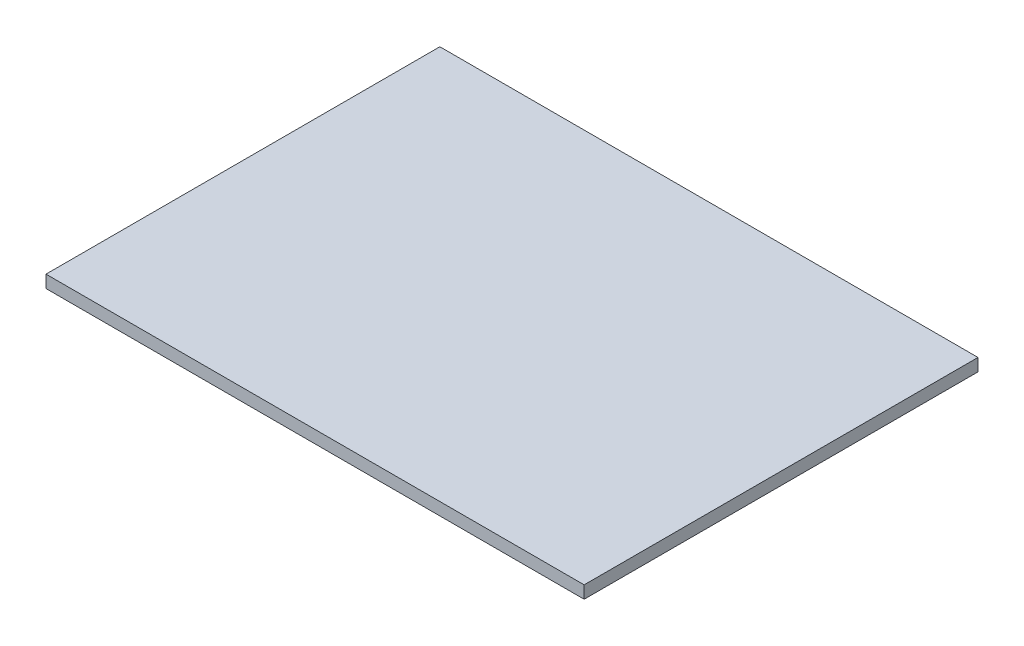
ISO-10303-21;
HEADER;
FILE_DESCRIPTION(('STEP AP214'),'2;1');
FILE_NAME('part.step','',(''),(''),'','','');
FILE_SCHEMA(('AUTOMOTIVE_DESIGN { 1 0 10303 214 1 1 1 1 }'));
ENDSEC;
DATA;
#1=APPLICATION_CONTEXT('core data for automotive mechanical design processes');
#2=APPLICATION_PROTOCOL_DEFINITION('international standard','automotive_design',2000,#1);
#3=PRODUCT_CONTEXT('',#1,'mechanical');
#4=PRODUCT('Part','Part','',(#3));
#5=PRODUCT_RELATED_PRODUCT_CATEGORY('part','',(#4));
#6=PRODUCT_DEFINITION_FORMATION('','',#4);
#7=PRODUCT_DEFINITION_CONTEXT('part definition',#1,'design');
#8=PRODUCT_DEFINITION('design','',#6,#7);
#9=PRODUCT_DEFINITION_SHAPE('','',#8);
#10=(LENGTH_UNIT() NAMED_UNIT(*) SI_UNIT(.MILLI.,.METRE.));
#11=(NAMED_UNIT(*) PLANE_ANGLE_UNIT() SI_UNIT($,.RADIAN.));
#12=(NAMED_UNIT(*) SI_UNIT($,.STERADIAN.) SOLID_ANGLE_UNIT());
#13=UNCERTAINTY_MEASURE_WITH_UNIT(LENGTH_MEASURE(1.E-05),#10,'distance_accuracy_value','');
#14=(GEOMETRIC_REPRESENTATION_CONTEXT(3) GLOBAL_UNCERTAINTY_ASSIGNED_CONTEXT((#13)) GLOBAL_UNIT_ASSIGNED_CONTEXT((#10,
#11,#12)) REPRESENTATION_CONTEXT('',''));
#15=CARTESIAN_POINT('',(0.,0.,0.));
#16=DIRECTION('',(0.,0.,1.));
#17=DIRECTION('',(1.,0.,0.));
#18=AXIS2_PLACEMENT_3D('',#15,#16,#17);
#19=CARTESIAN_POINT('',(0.,19.05,0.));
#20=DIRECTION('',(1.,0.,0.));
#21=DIRECTION('',(0.,0.,-1.));
#22=AXIS2_PLACEMENT_3D('',#19,#20,#21);
#23=PLANE('',#22);
#24=DIRECTION('',(0.,0.,1.));
#25=VECTOR('',#24,1.);
#26=CARTESIAN_POINT('',(0.,0.,0.));
#27=LINE('',#26,#25);
#28=CARTESIAN_POINT('',(0.,0.,-600.075));
#29=VERTEX_POINT('',#28);
#30=CARTESIAN_POINT('',(0.,0.,0.));
#31=VERTEX_POINT('',#30);
#32=EDGE_CURVE('E102',#29,#31,#27,.T.);
#33=ORIENTED_EDGE('',*,*,#32,.T.);
#34=DIRECTION('',(0.,-1.,0.));
#35=VECTOR('',#34,1.);
#36=CARTESIAN_POINT('',(0.,19.05,0.));
#37=LINE('',#36,#35);
#38=CARTESIAN_POINT('',(0.,19.05,0.));
#39=VERTEX_POINT('',#38);
#40=EDGE_CURVE('E11',#39,#31,#37,.T.);
#41=ORIENTED_EDGE('',*,*,#40,.F.);
#42=DIRECTION('',(0.,0.,1.));
#43=VECTOR('',#42,1.);
#44=CARTESIAN_POINT('',(0.,19.05,0.));
#45=LINE('',#44,#43);
#46=CARTESIAN_POINT('',(0.,19.05,-600.075));
#47=VERTEX_POINT('',#46);
#48=EDGE_CURVE('E90',#47,#39,#45,.T.);
#49=ORIENTED_EDGE('',*,*,#48,.F.);
#50=DIRECTION('',(0.,-1.,0.));
#51=VECTOR('',#50,1.);
#52=CARTESIAN_POINT('',(0.,19.05,-600.075));
#53=LINE('',#52,#51);
#54=EDGE_CURVE('E98',#47,#29,#53,.T.);
#55=ORIENTED_EDGE('',*,*,#54,.T.);
#56=EDGE_LOOP('',(#33,#41,#49,#55));
#57=FACE_BOUND('',#56,.T.);
#58=ADVANCED_FACE('F39',(#57),#23,.F.);
#59=CARTESIAN_POINT('',(0.,19.05,0.));
#60=DIRECTION('',(0.,0.,-1.));
#61=DIRECTION('',(-1.,0.,0.));
#62=AXIS2_PLACEMENT_3D('',#59,#60,#61);
#63=PLANE('',#62);
#64=DIRECTION('',(1.,0.,0.));
#65=VECTOR('',#64,1.);
#66=CARTESIAN_POINT('',(0.,0.,0.));
#67=LINE('',#66,#65);
#68=CARTESIAN_POINT('',(819.94375,0.,0.));
#69=VERTEX_POINT('',#68);
#70=EDGE_CURVE('E94',#31,#69,#67,.T.);
#71=ORIENTED_EDGE('',*,*,#70,.T.);
#72=DIRECTION('',(0.,-1.,0.));
#73=VECTOR('',#72,1.);
#74=CARTESIAN_POINT('',(819.94375,19.05,0.));
#75=LINE('',#74,#73);
#76=CARTESIAN_POINT('',(819.94375,19.05,0.));
#77=VERTEX_POINT('',#76);
#78=EDGE_CURVE('E47',#77,#69,#75,.T.);
#79=ORIENTED_EDGE('',*,*,#78,.F.);
#80=DIRECTION('',(1.,0.,0.));
#81=VECTOR('',#80,1.);
#82=CARTESIAN_POINT('',(0.,19.05,0.));
#83=LINE('',#82,#81);
#84=EDGE_CURVE('E85',#39,#77,#83,.T.);
#85=ORIENTED_EDGE('',*,*,#84,.F.);
#86=ORIENTED_EDGE('',*,*,#40,.T.);
#87=EDGE_LOOP('',(#71,#79,#85,#86));
#88=FACE_BOUND('',#87,.T.);
#89=ADVANCED_FACE('F93',(#88),#63,.F.);
#90=CARTESIAN_POINT('',(819.94375,19.05,0.));
#91=DIRECTION('',(-1.,0.,0.));
#92=DIRECTION('',(0.,0.,1.));
#93=AXIS2_PLACEMENT_3D('',#90,#91,#92);
#94=PLANE('',#93);
#95=DIRECTION('',(0.,0.,-1.));
#96=VECTOR('',#95,1.);
#97=CARTESIAN_POINT('',(819.94375,0.,0.));
#98=LINE('',#97,#96);
#99=CARTESIAN_POINT('',(819.94375,0.,-600.075));
#100=VERTEX_POINT('',#99);
#101=EDGE_CURVE('E72',#69,#100,#98,.T.);
#102=ORIENTED_EDGE('',*,*,#101,.T.);
#103=DIRECTION('',(0.,-1.,0.));
#104=VECTOR('',#103,1.);
#105=CARTESIAN_POINT('',(819.94375,19.05,-600.075));
#106=LINE('',#105,#104);
#107=CARTESIAN_POINT('',(819.94375,19.05,-600.075));
#108=VERTEX_POINT('',#107);
#109=EDGE_CURVE('E95',#108,#100,#106,.T.);
#110=ORIENTED_EDGE('',*,*,#109,.F.);
#111=DIRECTION('',(0.,0.,-1.));
#112=VECTOR('',#111,1.);
#113=CARTESIAN_POINT('',(819.94375,19.05,0.));
#114=LINE('',#113,#112);
#115=EDGE_CURVE('E88',#77,#108,#114,.T.);
#116=ORIENTED_EDGE('',*,*,#115,.F.);
#117=ORIENTED_EDGE('',*,*,#78,.T.);
#118=EDGE_LOOP('',(#102,#110,#116,#117));
#119=FACE_BOUND('',#118,.T.);
#120=ADVANCED_FACE('F96',(#119),#94,.F.);
#121=CARTESIAN_POINT('',(0.,19.05,-600.075));
#122=DIRECTION('',(0.,0.,1.));
#123=DIRECTION('',(1.,0.,0.));
#124=AXIS2_PLACEMENT_3D('',#121,#122,#123);
#125=PLANE('',#124);
#126=DIRECTION('',(-1.,0.,0.));
#127=VECTOR('',#126,1.);
#128=CARTESIAN_POINT('',(0.,0.,-600.075));
#129=LINE('',#128,#127);
#130=EDGE_CURVE('E78',#100,#29,#129,.T.);
#131=ORIENTED_EDGE('',*,*,#130,.T.);
#132=ORIENTED_EDGE('',*,*,#54,.F.);
#133=DIRECTION('',(-1.,0.,0.));
#134=VECTOR('',#133,1.);
#135=CARTESIAN_POINT('',(0.,19.05,-600.075));
#136=LINE('',#135,#134);
#137=EDGE_CURVE('E55',#108,#47,#136,.T.);
#138=ORIENTED_EDGE('',*,*,#137,.F.);
#139=ORIENTED_EDGE('',*,*,#109,.T.);
#140=EDGE_LOOP('',(#131,#132,#138,#139));
#141=FACE_BOUND('',#140,.T.);
#142=ADVANCED_FACE('F109',(#141),#125,.F.);
#143=CARTESIAN_POINT('',(0.,19.05,0.));
#144=DIRECTION('',(0.,-1.,0.));
#145=DIRECTION('',(0.,0.,-1.));
#146=AXIS2_PLACEMENT_3D('',#143,#144,#145);
#147=PLANE('',#146);
#148=ORIENTED_EDGE('',*,*,#48,.T.);
#149=ORIENTED_EDGE('',*,*,#84,.T.);
#150=ORIENTED_EDGE('',*,*,#115,.T.);
#151=ORIENTED_EDGE('',*,*,#137,.T.);
#152=EDGE_LOOP('',(#148,#149,#150,#151));
#153=FACE_BOUND('',#152,.T.);
#154=ADVANCED_FACE('F86',(#153),#147,.F.);
#155=CARTESIAN_POINT('',(0.,0.,0.));
#156=DIRECTION('',(0.,-1.,0.));
#157=DIRECTION('',(0.,0.,-1.));
#158=AXIS2_PLACEMENT_3D('',#155,#156,#157);
#159=PLANE('',#158);
#160=ORIENTED_EDGE('',*,*,#32,.F.);
#161=ORIENTED_EDGE('',*,*,#130,.F.);
#162=ORIENTED_EDGE('',*,*,#101,.F.);
#163=ORIENTED_EDGE('',*,*,#70,.F.);
#164=EDGE_LOOP('',(#160,#161,#162,#163));
#165=FACE_BOUND('',#164,.T.);
#166=ADVANCED_FACE('F112',(#165),#159,.T.);
#167=CLOSED_SHELL('',(#58,#89,#120,#142,#154,#166));
#168=MANIFOLD_SOLID_BREP('B2',#167);
#169=ADVANCED_BREP_SHAPE_REPRESENTATION('',(#18,#168),#14);
#170=SHAPE_DEFINITION_REPRESENTATION(#9,#169);
ENDSEC;
END-ISO-10303-21;
